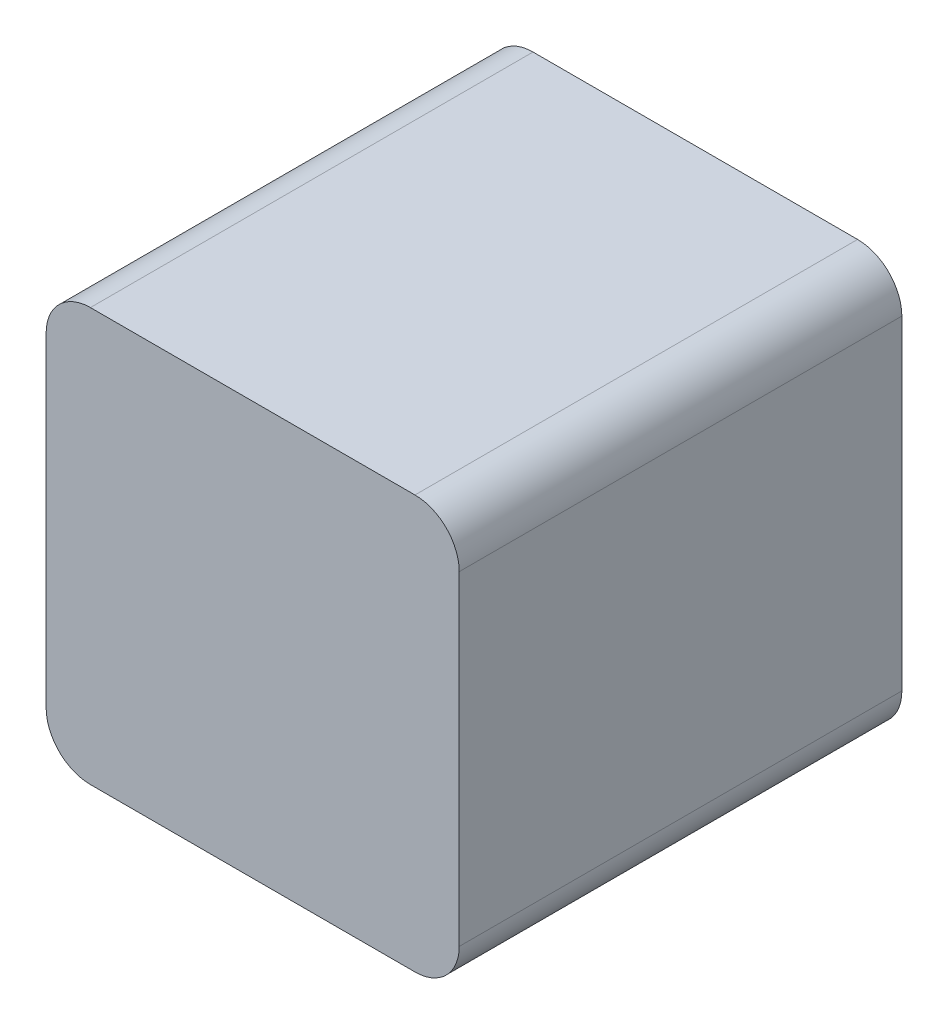
ISO-10303-21;
HEADER;
FILE_DESCRIPTION(('STEP AP214'),'2;1');
FILE_NAME('part.step','',(''),(''),'','','');
FILE_SCHEMA(('AUTOMOTIVE_DESIGN { 1 0 10303 214 1 1 1 1 }'));
ENDSEC;
DATA;
#1=APPLICATION_CONTEXT('core data for automotive mechanical design processes');
#2=APPLICATION_PROTOCOL_DEFINITION('international standard','automotive_design',2000,#1);
#3=PRODUCT_CONTEXT('',#1,'mechanical');
#4=PRODUCT('Part','Part','',(#3));
#5=PRODUCT_RELATED_PRODUCT_CATEGORY('part','',(#4));
#6=PRODUCT_DEFINITION_FORMATION('','',#4);
#7=PRODUCT_DEFINITION_CONTEXT('part definition',#1,'design');
#8=PRODUCT_DEFINITION('design','',#6,#7);
#9=PRODUCT_DEFINITION_SHAPE('','',#8);
#10=(LENGTH_UNIT() NAMED_UNIT(*) SI_UNIT(.MILLI.,.METRE.));
#11=(NAMED_UNIT(*) PLANE_ANGLE_UNIT() SI_UNIT($,.RADIAN.));
#12=(NAMED_UNIT(*) SI_UNIT($,.STERADIAN.) SOLID_ANGLE_UNIT());
#13=UNCERTAINTY_MEASURE_WITH_UNIT(LENGTH_MEASURE(1.E-05),#10,'distance_accuracy_value','');
#14=(GEOMETRIC_REPRESENTATION_CONTEXT(3) GLOBAL_UNCERTAINTY_ASSIGNED_CONTEXT((#13)) GLOBAL_UNIT_ASSIGNED_CONTEXT((#10,
#11,#12)) REPRESENTATION_CONTEXT('',''));
#15=CARTESIAN_POINT('',(0.,0.,0.));
#16=DIRECTION('',(0.,0.,1.));
#17=DIRECTION('',(1.,0.,0.));
#18=AXIS2_PLACEMENT_3D('',#15,#16,#17);
#19=CARTESIAN_POINT('',(-14.,-14.,15.));
#20=DIRECTION('',(0.,1.,0.));
#21=DIRECTION('',(0.,0.,1.));
#22=AXIS2_PLACEMENT_3D('',#19,#20,#21);
#23=PLANE('',#22);
#24=DIRECTION('',(1.,0.,0.));
#25=VECTOR('',#24,1.);
#26=CARTESIAN_POINT('',(-14.,-14.,-15.));
#27=LINE('',#26,#25);
#28=CARTESIAN_POINT('',(7.5,-14.,-15.));
#29=VERTEX_POINT('',#28);
#30=CARTESIAN_POINT('',(11.,-14.,-15.));
#31=VERTEX_POINT('',#30);
#32=EDGE_CURVE('E191',#29,#31,#27,.T.);
#33=ORIENTED_EDGE('',*,*,#32,.T.);
#34=DIRECTION('',(0.,0.,-1.));
#35=VECTOR('',#34,1.);
#36=CARTESIAN_POINT('',(11.,-14.,15.));
#37=LINE('',#36,#35);
#38=CARTESIAN_POINT('',(11.,-14.,15.));
#39=VERTEX_POINT('',#38);
#40=EDGE_CURVE('E211',#31,#39,#37,.F.);
#41=ORIENTED_EDGE('',*,*,#40,.T.);
#42=DIRECTION('',(1.,0.,0.));
#43=VECTOR('',#42,1.);
#44=CARTESIAN_POINT('',(-14.,-14.,15.));
#45=LINE('',#44,#43);
#46=CARTESIAN_POINT('',(-11.,-14.,15.));
#47=VERTEX_POINT('',#46);
#48=EDGE_CURVE('E179',#47,#39,#45,.T.);
#49=ORIENTED_EDGE('',*,*,#48,.F.);
#50=DIRECTION('',(0.,0.,-1.));
#51=VECTOR('',#50,1.);
#52=CARTESIAN_POINT('',(-11.,-14.,15.));
#53=LINE('',#52,#51);
#54=CARTESIAN_POINT('',(-11.,-14.,-15.));
#55=VERTEX_POINT('',#54);
#56=EDGE_CURVE('E208',#47,#55,#53,.T.);
#57=ORIENTED_EDGE('',*,*,#56,.T.);
#58=CARTESIAN_POINT('',(-7.5,-14.,-15.));
#59=VERTEX_POINT('',#58);
#60=EDGE_CURVE('E173',#55,#59,#27,.T.);
#61=ORIENTED_EDGE('',*,*,#60,.T.);
#62=DIRECTION('',(0.,0.,-1.));
#63=VECTOR('',#62,1.);
#64=CARTESIAN_POINT('',(-7.50000000000001,-14.,15.));
#65=LINE('',#64,#63);
#66=CARTESIAN_POINT('',(-7.5,-14.,-8.));
#67=VERTEX_POINT('',#66);
#68=EDGE_CURVE('E157',#67,#59,#65,.T.);
#69=ORIENTED_EDGE('',*,*,#68,.F.);
#70=DIRECTION('',(-1.,0.,0.));
#71=VECTOR('',#70,1.);
#72=CARTESIAN_POINT('',(-14.,-14.,-8.));
#73=LINE('',#72,#71);
#74=CARTESIAN_POINT('',(7.5,-14.,-8.));
#75=VERTEX_POINT('',#74);
#76=EDGE_CURVE('E182',#75,#67,#73,.T.);
#77=ORIENTED_EDGE('',*,*,#76,.F.);
#78=DIRECTION('',(0.,0.,1.));
#79=VECTOR('',#78,1.);
#80=CARTESIAN_POINT('',(7.5,-14.,15.));
#81=LINE('',#80,#79);
#82=EDGE_CURVE('E158',#29,#75,#81,.T.);
#83=ORIENTED_EDGE('',*,*,#82,.F.);
#84=EDGE_LOOP('',(#33,#41,#49,#57,#61,#69,#77,#83));
#85=FACE_BOUND('',#84,.T.);
#86=ADVANCED_FACE('F40',(#85),#23,.F.);
#87=CARTESIAN_POINT('',(14.,14.,15.));
#88=DIRECTION('',(-1.,0.,0.));
#89=DIRECTION('',(0.,-1.,0.));
#90=AXIS2_PLACEMENT_3D('',#87,#88,#89);
#91=PLANE('',#90);
#92=DIRECTION('',(0.,1.,0.));
#93=VECTOR('',#92,1.);
#94=CARTESIAN_POINT('',(14.,14.,15.));
#95=LINE('',#94,#93);
#96=CARTESIAN_POINT('',(14.,-11.,15.));
#97=VERTEX_POINT('',#96);
#98=CARTESIAN_POINT('',(14.,11.,15.));
#99=VERTEX_POINT('',#98);
#100=EDGE_CURVE('E168',#97,#99,#95,.T.);
#101=ORIENTED_EDGE('',*,*,#100,.F.);
#102=DIRECTION('',(0.,0.,-1.));
#103=VECTOR('',#102,1.);
#104=CARTESIAN_POINT('',(14.,-11.,15.));
#105=LINE('',#104,#103);
#106=CARTESIAN_POINT('',(14.,-11.,-15.));
#107=VERTEX_POINT('',#106);
#108=EDGE_CURVE('E197',#97,#107,#105,.T.);
#109=ORIENTED_EDGE('',*,*,#108,.T.);
#110=DIRECTION('',(0.,1.,0.));
#111=VECTOR('',#110,1.);
#112=CARTESIAN_POINT('',(14.,14.,-15.));
#113=LINE('',#112,#111);
#114=CARTESIAN_POINT('',(14.,11.,-15.));
#115=VERTEX_POINT('',#114);
#116=EDGE_CURVE('E167',#107,#115,#113,.T.);
#117=ORIENTED_EDGE('',*,*,#116,.T.);
#118=DIRECTION('',(0.,0.,-1.));
#119=VECTOR('',#118,1.);
#120=CARTESIAN_POINT('',(14.,11.,15.));
#121=LINE('',#120,#119);
#122=EDGE_CURVE('E195',#115,#99,#121,.F.);
#123=ORIENTED_EDGE('',*,*,#122,.T.);
#124=EDGE_LOOP('',(#101,#109,#117,#123));
#125=FACE_BOUND('',#124,.T.);
#126=ADVANCED_FACE('F253',(#125),#91,.F.);
#127=CARTESIAN_POINT('',(-14.,14.,15.));
#128=DIRECTION('',(0.,-1.,0.));
#129=DIRECTION('',(0.,0.,-1.));
#130=AXIS2_PLACEMENT_3D('',#127,#128,#129);
#131=PLANE('',#130);
#132=DIRECTION('',(-1.,0.,0.));
#133=VECTOR('',#132,1.);
#134=CARTESIAN_POINT('',(-14.,14.,-15.));
#135=LINE('',#134,#133);
#136=CARTESIAN_POINT('',(11.,14.,-15.));
#137=VERTEX_POINT('',#136);
#138=CARTESIAN_POINT('',(-11.,14.,-15.));
#139=VERTEX_POINT('',#138);
#140=EDGE_CURVE('E185',#137,#139,#135,.T.);
#141=ORIENTED_EDGE('',*,*,#140,.T.);
#142=DIRECTION('',(0.,0.,-1.));
#143=VECTOR('',#142,1.);
#144=CARTESIAN_POINT('',(-11.,14.,15.));
#145=LINE('',#144,#143);
#146=CARTESIAN_POINT('',(-11.,14.,15.));
#147=VERTEX_POINT('',#146);
#148=EDGE_CURVE('E11',#139,#147,#145,.F.);
#149=ORIENTED_EDGE('',*,*,#148,.T.);
#150=DIRECTION('',(-1.,0.,0.));
#151=VECTOR('',#150,1.);
#152=CARTESIAN_POINT('',(-14.,14.,15.));
#153=LINE('',#152,#151);
#154=CARTESIAN_POINT('',(11.,14.,15.));
#155=VERTEX_POINT('',#154);
#156=EDGE_CURVE('E172',#155,#147,#153,.T.);
#157=ORIENTED_EDGE('',*,*,#156,.F.);
#158=DIRECTION('',(0.,0.,-1.));
#159=VECTOR('',#158,1.);
#160=CARTESIAN_POINT('',(11.,14.,15.));
#161=LINE('',#160,#159);
#162=EDGE_CURVE('E49',#155,#137,#161,.T.);
#163=ORIENTED_EDGE('',*,*,#162,.T.);
#164=EDGE_LOOP('',(#141,#149,#157,#163));
#165=FACE_BOUND('',#164,.T.);
#166=ADVANCED_FACE('F229',(#165),#131,.F.);
#167=CARTESIAN_POINT('',(-14.,14.,15.));
#168=DIRECTION('',(1.,0.,0.));
#169=DIRECTION('',(0.,1.,0.));
#170=AXIS2_PLACEMENT_3D('',#167,#168,#169);
#171=PLANE('',#170);
#172=DIRECTION('',(0.,-1.,0.));
#173=VECTOR('',#172,1.);
#174=CARTESIAN_POINT('',(-14.,14.,-15.));
#175=LINE('',#174,#173);
#176=CARTESIAN_POINT('',(-14.,11.,-15.));
#177=VERTEX_POINT('',#176);
#178=CARTESIAN_POINT('',(-14.,-11.,-15.));
#179=VERTEX_POINT('',#178);
#180=EDGE_CURVE('E189',#177,#179,#175,.T.);
#181=ORIENTED_EDGE('',*,*,#180,.T.);
#182=DIRECTION('',(0.,0.,-1.));
#183=VECTOR('',#182,1.);
#184=CARTESIAN_POINT('',(-14.,-11.,15.));
#185=LINE('',#184,#183);
#186=CARTESIAN_POINT('',(-14.,-11.,15.));
#187=VERTEX_POINT('',#186);
#188=EDGE_CURVE('E56',#179,#187,#185,.F.);
#189=ORIENTED_EDGE('',*,*,#188,.T.);
#190=DIRECTION('',(0.,-1.,0.));
#191=VECTOR('',#190,1.);
#192=CARTESIAN_POINT('',(-14.,14.,15.));
#193=LINE('',#192,#191);
#194=CARTESIAN_POINT('',(-14.,11.,15.));
#195=VERTEX_POINT('',#194);
#196=EDGE_CURVE('E176',#195,#187,#193,.T.);
#197=ORIENTED_EDGE('',*,*,#196,.F.);
#198=DIRECTION('',(0.,0.,-1.));
#199=VECTOR('',#198,1.);
#200=CARTESIAN_POINT('',(-14.,11.,15.));
#201=LINE('',#200,#199);
#202=EDGE_CURVE('E221',#195,#177,#201,.T.);
#203=ORIENTED_EDGE('',*,*,#202,.T.);
#204=EDGE_LOOP('',(#181,#189,#197,#203));
#205=FACE_BOUND('',#204,.T.);
#206=ADVANCED_FACE('F237',(#205),#171,.F.);
#207=CARTESIAN_POINT('',(0.,0.,15.));
#208=DIRECTION('',(0.,0.,1.));
#209=DIRECTION('',(1.,0.,0.));
#210=AXIS2_PLACEMENT_3D('',#207,#208,#209);
#211=PLANE('',#210);
#212=ORIENTED_EDGE('',*,*,#48,.T.);
#213=CARTESIAN_POINT('',(11.,-11.,15.));
#214=DIRECTION('',(0.,0.,1.));
#215=DIRECTION('',(1.,0.,0.));
#216=AXIS2_PLACEMENT_3D('',#213,#214,#215);
#217=CIRCLE('',#216,3.);
#218=EDGE_CURVE('E219',#39,#97,#217,.T.);
#219=ORIENTED_EDGE('',*,*,#218,.T.);
#220=ORIENTED_EDGE('',*,*,#100,.T.);
#221=CARTESIAN_POINT('',(11.,11.,15.));
#222=DIRECTION('',(0.,0.,1.));
#223=DIRECTION('',(1.,0.,0.));
#224=AXIS2_PLACEMENT_3D('',#221,#222,#223);
#225=CIRCLE('',#224,3.);
#226=EDGE_CURVE('E213',#99,#155,#225,.T.);
#227=ORIENTED_EDGE('',*,*,#226,.T.);
#228=ORIENTED_EDGE('',*,*,#156,.T.);
#229=CARTESIAN_POINT('',(-11.,11.,15.));
#230=DIRECTION('',(0.,0.,1.));
#231=DIRECTION('',(1.,0.,0.));
#232=AXIS2_PLACEMENT_3D('',#229,#230,#231);
#233=CIRCLE('',#232,3.);
#234=EDGE_CURVE('E63',#147,#195,#233,.T.);
#235=ORIENTED_EDGE('',*,*,#234,.T.);
#236=ORIENTED_EDGE('',*,*,#196,.T.);
#237=CARTESIAN_POINT('',(-11.,-11.,15.));
#238=DIRECTION('',(0.,0.,1.));
#239=DIRECTION('',(1.,0.,0.));
#240=AXIS2_PLACEMENT_3D('',#237,#238,#239);
#241=CIRCLE('',#240,3.);
#242=EDGE_CURVE('E217',#187,#47,#241,.T.);
#243=ORIENTED_EDGE('',*,*,#242,.T.);
#244=EDGE_LOOP('',(#212,#219,#220,#227,#228,#235,#236,#243));
#245=FACE_BOUND('',#244,.T.);
#246=ADVANCED_FACE('F239',(#245),#211,.T.);
#247=CARTESIAN_POINT('',(0.,0.,-15.));
#248=DIRECTION('',(0.,0.,1.));
#249=DIRECTION('',(1.,0.,0.));
#250=AXIS2_PLACEMENT_3D('',#247,#248,#249);
#251=PLANE('',#250);
#252=ORIENTED_EDGE('',*,*,#116,.F.);
#253=CARTESIAN_POINT('',(11.,-11.,-15.));
#254=DIRECTION('',(0.,0.,1.));
#255=DIRECTION('',(1.,0.,0.));
#256=AXIS2_PLACEMENT_3D('',#253,#254,#255);
#257=CIRCLE('',#256,3.);
#258=EDGE_CURVE('E206',#107,#31,#257,.F.);
#259=ORIENTED_EDGE('',*,*,#258,.T.);
#260=ORIENTED_EDGE('',*,*,#32,.F.);
#261=DIRECTION('',(0.,1.,0.));
#262=VECTOR('',#261,1.);
#263=CARTESIAN_POINT('',(7.5,-15.5,-15.));
#264=LINE('',#263,#262);
#265=CARTESIAN_POINT('',(7.5,-15.5,-15.));
#266=VERTEX_POINT('',#265);
#267=EDGE_CURVE('E141',#266,#29,#264,.T.);
#268=ORIENTED_EDGE('',*,*,#267,.F.);
#269=DIRECTION('',(1.,0.,0.));
#270=VECTOR('',#269,1.);
#271=CARTESIAN_POINT('',(-7.5,-15.5,-15.));
#272=LINE('',#271,#270);
#273=CARTESIAN_POINT('',(-7.5,-15.5,-15.));
#274=VERTEX_POINT('',#273);
#275=EDGE_CURVE('E132',#274,#266,#272,.T.);
#276=ORIENTED_EDGE('',*,*,#275,.F.);
#277=DIRECTION('',(0.,1.,0.));
#278=VECTOR('',#277,1.);
#279=CARTESIAN_POINT('',(-7.5,-15.5,-15.));
#280=LINE('',#279,#278);
#281=EDGE_CURVE('E138',#274,#59,#280,.T.);
#282=ORIENTED_EDGE('',*,*,#281,.T.);
#283=ORIENTED_EDGE('',*,*,#60,.F.);
#284=CARTESIAN_POINT('',(-11.,-11.,-15.));
#285=DIRECTION('',(0.,0.,1.));
#286=DIRECTION('',(1.,0.,0.));
#287=AXIS2_PLACEMENT_3D('',#284,#285,#286);
#288=CIRCLE('',#287,3.);
#289=EDGE_CURVE('E204',#55,#179,#288,.F.);
#290=ORIENTED_EDGE('',*,*,#289,.T.);
#291=ORIENTED_EDGE('',*,*,#180,.F.);
#292=CARTESIAN_POINT('',(-11.,11.,-15.));
#293=DIRECTION('',(0.,0.,1.));
#294=DIRECTION('',(1.,0.,0.));
#295=AXIS2_PLACEMENT_3D('',#292,#293,#294);
#296=CIRCLE('',#295,3.);
#297=EDGE_CURVE('E202',#177,#139,#296,.F.);
#298=ORIENTED_EDGE('',*,*,#297,.T.);
#299=ORIENTED_EDGE('',*,*,#140,.F.);
#300=CARTESIAN_POINT('',(11.,11.,-15.));
#301=DIRECTION('',(0.,0.,1.));
#302=DIRECTION('',(1.,0.,0.));
#303=AXIS2_PLACEMENT_3D('',#300,#301,#302);
#304=CIRCLE('',#303,3.);
#305=EDGE_CURVE('E200',#137,#115,#304,.F.);
#306=ORIENTED_EDGE('',*,*,#305,.T.);
#307=EDGE_LOOP('',(#252,#259,#260,#268,#276,#282,#283,#290,#291,#298,#299,#306));
#308=FACE_BOUND('',#307,.T.);
#309=ADVANCED_FACE('F135',(#308),#251,.F.);
#310=CARTESIAN_POINT('',(-7.5,-15.5,-8.));
#311=DIRECTION('',(0.,0.,-1.));
#312=DIRECTION('',(-1.,0.,0.));
#313=AXIS2_PLACEMENT_3D('',#310,#311,#312);
#314=PLANE('',#313);
#315=DIRECTION('',(0.,1.,0.));
#316=VECTOR('',#315,1.);
#317=CARTESIAN_POINT('',(7.5,-15.5,-8.));
#318=LINE('',#317,#316);
#319=CARTESIAN_POINT('',(7.5,-15.5,-8.));
#320=VERTEX_POINT('',#319);
#321=EDGE_CURVE('E162',#320,#75,#318,.T.);
#322=ORIENTED_EDGE('',*,*,#321,.T.);
#323=ORIENTED_EDGE('',*,*,#76,.T.);
#324=DIRECTION('',(0.,1.,0.));
#325=VECTOR('',#324,1.);
#326=CARTESIAN_POINT('',(-7.5,-15.5,-8.));
#327=LINE('',#326,#325);
#328=CARTESIAN_POINT('',(-7.5,-15.5,-8.));
#329=VERTEX_POINT('',#328);
#330=EDGE_CURVE('E261',#329,#67,#327,.T.);
#331=ORIENTED_EDGE('',*,*,#330,.F.);
#332=DIRECTION('',(-1.,0.,0.));
#333=VECTOR('',#332,1.);
#334=CARTESIAN_POINT('',(-7.5,-15.5,-8.));
#335=LINE('',#334,#333);
#336=EDGE_CURVE('E150',#320,#329,#335,.T.);
#337=ORIENTED_EDGE('',*,*,#336,.F.);
#338=EDGE_LOOP('',(#322,#323,#331,#337));
#339=FACE_BOUND('',#338,.T.);
#340=ADVANCED_FACE('F260',(#339),#314,.F.);
#341=CARTESIAN_POINT('',(-7.5,-15.5,-8.));
#342=DIRECTION('',(1.,0.,0.));
#343=DIRECTION('',(0.,0.,-1.));
#344=AXIS2_PLACEMENT_3D('',#341,#342,#343);
#345=PLANE('',#344);
#346=ORIENTED_EDGE('',*,*,#330,.T.);
#347=ORIENTED_EDGE('',*,*,#68,.T.);
#348=ORIENTED_EDGE('',*,*,#281,.F.);
#349=DIRECTION('',(0.,0.,-1.));
#350=VECTOR('',#349,1.);
#351=CARTESIAN_POINT('',(-7.5,-15.5,-8.));
#352=LINE('',#351,#350);
#353=EDGE_CURVE('E145',#329,#274,#352,.T.);
#354=ORIENTED_EDGE('',*,*,#353,.F.);
#355=EDGE_LOOP('',(#346,#347,#348,#354));
#356=FACE_BOUND('',#355,.T.);
#357=ADVANCED_FACE('F156',(#356),#345,.F.);
#358=CARTESIAN_POINT('',(7.5,-15.5,-8.));
#359=DIRECTION('',(-1.,0.,0.));
#360=DIRECTION('',(0.,0.,1.));
#361=AXIS2_PLACEMENT_3D('',#358,#359,#360);
#362=PLANE('',#361);
#363=ORIENTED_EDGE('',*,*,#267,.T.);
#364=ORIENTED_EDGE('',*,*,#82,.T.);
#365=ORIENTED_EDGE('',*,*,#321,.F.);
#366=DIRECTION('',(0.,0.,1.));
#367=VECTOR('',#366,1.);
#368=CARTESIAN_POINT('',(7.5,-15.5,-8.));
#369=LINE('',#368,#367);
#370=EDGE_CURVE('E144',#266,#320,#369,.T.);
#371=ORIENTED_EDGE('',*,*,#370,.F.);
#372=EDGE_LOOP('',(#363,#364,#365,#371));
#373=FACE_BOUND('',#372,.T.);
#374=ADVANCED_FACE('F258',(#373),#362,.F.);
#375=CARTESIAN_POINT('',(0.,-15.5,0.));
#376=DIRECTION('',(0.,-1.,0.));
#377=DIRECTION('',(0.,0.,-1.));
#378=AXIS2_PLACEMENT_3D('',#375,#376,#377);
#379=PLANE('',#378);
#380=ORIENTED_EDGE('',*,*,#353,.T.);
#381=ORIENTED_EDGE('',*,*,#275,.T.);
#382=ORIENTED_EDGE('',*,*,#370,.T.);
#383=ORIENTED_EDGE('',*,*,#336,.T.);
#384=EDGE_LOOP('',(#380,#381,#382,#383));
#385=FACE_BOUND('',#384,.T.);
#386=ADVANCED_FACE('F148',(#385),#379,.T.);
#387=CARTESIAN_POINT('',(11.,-11.,15.));
#388=DIRECTION('',(0.,0.,-1.));
#389=DIRECTION('',(-1.,0.,0.));
#390=AXIS2_PLACEMENT_3D('',#387,#388,#389);
#391=CYLINDRICAL_SURFACE('',#390,3.);
#392=ORIENTED_EDGE('',*,*,#218,.F.);
#393=ORIENTED_EDGE('',*,*,#40,.F.);
#394=ORIENTED_EDGE('',*,*,#258,.F.);
#395=ORIENTED_EDGE('',*,*,#108,.F.);
#396=EDGE_LOOP('',(#392,#393,#394,#395));
#397=FACE_BOUND('',#396,.T.);
#398=ADVANCED_FACE('F251',(#397),#391,.T.);
#399=CARTESIAN_POINT('',(-11.,-11.,15.));
#400=DIRECTION('',(0.,0.,-1.));
#401=DIRECTION('',(-1.,0.,0.));
#402=AXIS2_PLACEMENT_3D('',#399,#400,#401);
#403=CYLINDRICAL_SURFACE('',#402,3.);
#404=ORIENTED_EDGE('',*,*,#242,.F.);
#405=ORIENTED_EDGE('',*,*,#188,.F.);
#406=ORIENTED_EDGE('',*,*,#289,.F.);
#407=ORIENTED_EDGE('',*,*,#56,.F.);
#408=EDGE_LOOP('',(#404,#405,#406,#407));
#409=FACE_BOUND('',#408,.T.);
#410=ADVANCED_FACE('F243',(#409),#403,.T.);
#411=CARTESIAN_POINT('',(-11.,11.,15.));
#412=DIRECTION('',(0.,0.,-1.));
#413=DIRECTION('',(-1.,0.,0.));
#414=AXIS2_PLACEMENT_3D('',#411,#412,#413);
#415=CYLINDRICAL_SURFACE('',#414,3.);
#416=ORIENTED_EDGE('',*,*,#234,.F.);
#417=ORIENTED_EDGE('',*,*,#148,.F.);
#418=ORIENTED_EDGE('',*,*,#297,.F.);
#419=ORIENTED_EDGE('',*,*,#202,.F.);
#420=EDGE_LOOP('',(#416,#417,#418,#419));
#421=FACE_BOUND('',#420,.T.);
#422=ADVANCED_FACE('F236',(#421),#415,.T.);
#423=CARTESIAN_POINT('',(11.,11.,15.));
#424=DIRECTION('',(0.,0.,-1.));
#425=DIRECTION('',(-1.,0.,0.));
#426=AXIS2_PLACEMENT_3D('',#423,#424,#425);
#427=CYLINDRICAL_SURFACE('',#426,3.);
#428=ORIENTED_EDGE('',*,*,#226,.F.);
#429=ORIENTED_EDGE('',*,*,#122,.F.);
#430=ORIENTED_EDGE('',*,*,#305,.F.);
#431=ORIENTED_EDGE('',*,*,#162,.F.);
#432=EDGE_LOOP('',(#428,#429,#430,#431));
#433=FACE_BOUND('',#432,.T.);
#434=ADVANCED_FACE('F42',(#433),#427,.T.);
#435=CLOSED_SHELL('',(#86,#126,#166,#206,#246,#309,#340,#357,#374,#386,#398,#410,#422,#434));
#436=MANIFOLD_SOLID_BREP('B2',#435);
#437=ADVANCED_BREP_SHAPE_REPRESENTATION('',(#18,#436),#14);
#438=SHAPE_DEFINITION_REPRESENTATION(#9,#437);
ENDSEC;
END-ISO-10303-21;
